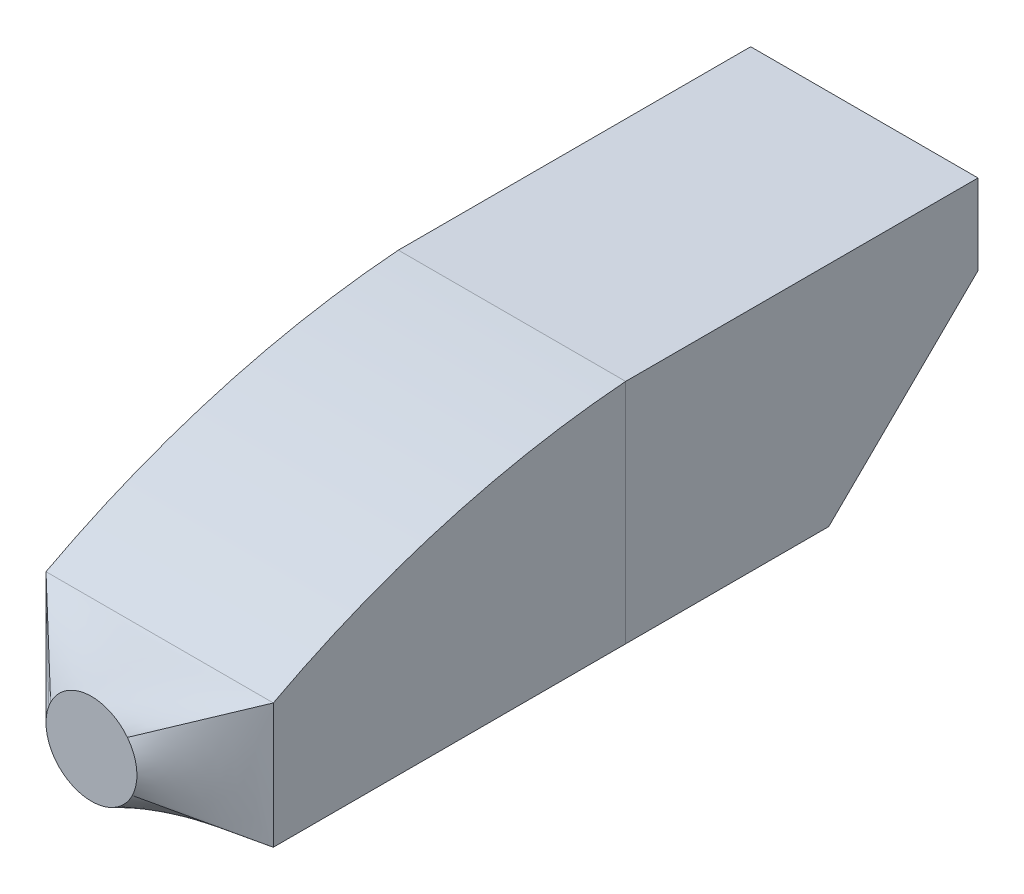
ISO-10303-21;
HEADER;
FILE_DESCRIPTION(('STEP AP214'),'2;1');
FILE_NAME('part.step','',(''),(''),'','','');
FILE_SCHEMA(('AUTOMOTIVE_DESIGN { 1 0 10303 214 1 1 1 1 }'));
ENDSEC;
DATA;
#1=APPLICATION_CONTEXT('core data for automotive mechanical design processes');
#2=APPLICATION_PROTOCOL_DEFINITION('international standard','automotive_design',2000,#1);
#3=PRODUCT_CONTEXT('',#1,'mechanical');
#4=PRODUCT('Part','Part','',(#3));
#5=PRODUCT_RELATED_PRODUCT_CATEGORY('part','',(#4));
#6=PRODUCT_DEFINITION_FORMATION('','',#4);
#7=PRODUCT_DEFINITION_CONTEXT('part definition',#1,'design');
#8=PRODUCT_DEFINITION('design','',#6,#7);
#9=PRODUCT_DEFINITION_SHAPE('','',#8);
#10=(LENGTH_UNIT() NAMED_UNIT(*) SI_UNIT(.MILLI.,.METRE.));
#11=(NAMED_UNIT(*) PLANE_ANGLE_UNIT() SI_UNIT($,.RADIAN.));
#12=(NAMED_UNIT(*) SI_UNIT($,.STERADIAN.) SOLID_ANGLE_UNIT());
#13=UNCERTAINTY_MEASURE_WITH_UNIT(LENGTH_MEASURE(1.E-05),#10,'distance_accuracy_value','');
#14=(GEOMETRIC_REPRESENTATION_CONTEXT(3) GLOBAL_UNCERTAINTY_ASSIGNED_CONTEXT((#13)) GLOBAL_UNIT_ASSIGNED_CONTEXT((#10,
#11,#12)) REPRESENTATION_CONTEXT('',''));
#15=CARTESIAN_POINT('',(0.,0.,0.));
#16=DIRECTION('',(0.,0.,1.));
#17=DIRECTION('',(1.,0.,0.));
#18=AXIS2_PLACEMENT_3D('',#15,#16,#17);
#19=CARTESIAN_POINT('',(-0.011546711005811,50.,0.));
#20=DIRECTION('',(0.,0.,1.));
#21=DIRECTION('',(1.,0.,0.));
#22=AXIS2_PLACEMENT_3D('',#19,#20,#21);
#23=PLANE('',#22);
#24=DIRECTION('',(1.,0.,0.));
#25=VECTOR('',#24,1.);
#26=CARTESIAN_POINT('',(100.,-50.,0.));
#27=LINE('',#26,#25);
#28=CARTESIAN_POINT('',(0.,-50.,0.));
#29=VERTEX_POINT('',#28);
#30=CARTESIAN_POINT('',(100.,-50.,0.));
#31=VERTEX_POINT('',#30);
#32=EDGE_CURVE('E160',#29,#31,#27,.T.);
#33=ORIENTED_EDGE('',*,*,#32,.F.);
#34=DIRECTION('',(0.,1.,0.));
#35=VECTOR('',#34,1.);
#36=CARTESIAN_POINT('',(0.,-345.373171481383,0.));
#37=LINE('',#36,#35);
#38=CARTESIAN_POINT('',(0.,50.,0.));
#39=VERTEX_POINT('',#38);
#40=EDGE_CURVE('E13',#29,#39,#37,.T.);
#41=ORIENTED_EDGE('',*,*,#40,.T.);
#42=DIRECTION('',(-1.,0.,0.));
#43=VECTOR('',#42,1.);
#44=CARTESIAN_POINT('',(100.,50.,0.));
#45=LINE('',#44,#43);
#46=CARTESIAN_POINT('',(100.,50.,0.));
#47=VERTEX_POINT('',#46);
#48=EDGE_CURVE('E619',#47,#39,#45,.T.);
#49=ORIENTED_EDGE('',*,*,#48,.F.);
#50=DIRECTION('',(0.,1.,0.));
#51=VECTOR('',#50,1.);
#52=CARTESIAN_POINT('',(100.,-345.373171481383,0.));
#53=LINE('',#52,#51);
#54=EDGE_CURVE('E154',#31,#47,#53,.T.);
#55=ORIENTED_EDGE('',*,*,#54,.F.);
#56=EDGE_LOOP('',(#33,#41,#49,#55));
#57=FACE_BOUND('',#56,.T.);
#58=ADVANCED_FACE('F151',(#57),#23,.F.);
#59=CARTESIAN_POINT('',(100.,-345.373171481383,-30.753501397821));
#60=DIRECTION('',(-1.,0.,0.));
#61=DIRECTION('',(0.,0.,1.));
#62=AXIS2_PLACEMENT_3D('',#59,#60,#61);
#63=CYLINDRICAL_SURFACE('',#62,396.567425005475);
#64=CARTESIAN_POINT('',(0.,-345.373171481383,-30.753501397821));
#65=DIRECTION('',(1.,0.,0.));
#66=DIRECTION('',(0.,0.,1.));
#67=AXIS2_PLACEMENT_3D('',#64,#65,#66);
#68=CIRCLE('',#67,396.567425005475);
#69=CARTESIAN_POINT('',(0.,5.,155.));
#70=VERTEX_POINT('',#69);
#71=EDGE_CURVE('E243',#39,#70,#68,.T.);
#72=ORIENTED_EDGE('',*,*,#71,.T.);
#73=CARTESIAN_POINT('',(99.9999999999998,4.99999999999992,155.));
#74=CARTESIAN_POINT('',(95.8333333333332,4.99999999999993,155.));
#75=CARTESIAN_POINT('',(87.4999999999999,4.99999999999994,155.));
#76=CARTESIAN_POINT('',(74.9999999999999,4.99999999999996,155.));
#77=CARTESIAN_POINT('',(62.5,4.99999999999996,155.));
#78=CARTESIAN_POINT('',(50.,4.99999999999996,155.));
#79=CARTESIAN_POINT('',(37.5,4.99999999999996,155.));
#80=CARTESIAN_POINT('',(25.0000000000001,4.99999999999995,155.));
#81=CARTESIAN_POINT('',(12.5000000000001,4.99999999999993,155.));
#82=CARTESIAN_POINT('',(4.16666666666682,4.99999999999991,155.));
#83=CARTESIAN_POINT('',(1.70715580257009E-13,4.9999999999999,155.));
#84=B_SPLINE_CURVE_WITH_KNOTS('',3,(#73,#74,#75,#76,#77,#78,#79,#80,#81,#82,#83),.UNSPECIFIED.,
.F.,.F.,(4,1,1,1,1,1,1,1,4),(0.,0.125,0.25,0.375,0.5,0.625,0.75,0.875,1.),.UNSPECIFIED.);
#85=CARTESIAN_POINT('',(100.,5.,155.));
#86=VERTEX_POINT('',#85);
#87=EDGE_CURVE('E411',#86,#70,#84,.T.);
#88=ORIENTED_EDGE('',*,*,#87,.F.);
#89=CARTESIAN_POINT('',(100.,-345.373171481383,-30.753501397821));
#90=DIRECTION('',(1.,0.,0.));
#91=DIRECTION('',(0.,0.,1.));
#92=AXIS2_PLACEMENT_3D('',#89,#90,#91);
#93=CIRCLE('',#92,396.567425005475);
#94=EDGE_CURVE('E415',#47,#86,#93,.T.);
#95=ORIENTED_EDGE('',*,*,#94,.F.);
#96=ORIENTED_EDGE('',*,*,#48,.T.);
#97=EDGE_LOOP('',(#72,#88,#95,#96));
#98=FACE_BOUND('',#97,.T.);
#99=ADVANCED_FACE('F417',(#98),#63,.T.);
#100=CARTESIAN_POINT('',(100.,-50.,-89.3390832636151));
#101=DIRECTION('',(0.,1.,0.));
#102=DIRECTION('',(0.,0.,1.));
#103=AXIS2_PLACEMENT_3D('',#100,#101,#102);
#104=PLANE('',#103);
#105=DIRECTION('',(0.,0.,-1.));
#106=VECTOR('',#105,1.);
#107=CARTESIAN_POINT('',(0.,-50.,-89.3390832636151));
#108=LINE('',#107,#106);
#109=CARTESIAN_POINT('',(0.,-50.,155.));
#110=VERTEX_POINT('',#109);
#111=EDGE_CURVE('E440',#110,#29,#108,.T.);
#112=ORIENTED_EDGE('',*,*,#111,.T.);
#113=ORIENTED_EDGE('',*,*,#32,.T.);
#114=DIRECTION('',(0.,0.,-1.));
#115=VECTOR('',#114,1.);
#116=CARTESIAN_POINT('',(100.,-50.,-89.3390832636151));
#117=LINE('',#116,#115);
#118=CARTESIAN_POINT('',(100.,-50.,155.));
#119=VERTEX_POINT('',#118);
#120=EDGE_CURVE('E515',#119,#31,#117,.T.);
#121=ORIENTED_EDGE('',*,*,#120,.F.);
#122=CARTESIAN_POINT('',(0.,-50.,155.));
#123=CARTESIAN_POINT('',(4.16666666666667,-50.,155.));
#124=CARTESIAN_POINT('',(12.5,-50.,155.));
#125=CARTESIAN_POINT('',(25.,-50.,155.));
#126=CARTESIAN_POINT('',(37.5,-50.,155.));
#127=CARTESIAN_POINT('',(50.,-50.,155.));
#128=CARTESIAN_POINT('',(62.5,-50.,155.));
#129=CARTESIAN_POINT('',(75.,-50.,155.));
#130=CARTESIAN_POINT('',(87.5,-50.,155.));
#131=CARTESIAN_POINT('',(95.8333333333333,-50.,155.));
#132=CARTESIAN_POINT('',(100.,-50.,155.));
#133=B_SPLINE_CURVE_WITH_KNOTS('',3,(#122,#123,#124,#125,#126,#127,#128,#129,#130,#131,#132),
.UNSPECIFIED.,.F.,.F.,(4,1,1,1,1,1,1,1,4),(0.,0.125,0.25,0.375,0.5,0.625,0.75,0.875,1.),.UNSPECIFIED.);
#134=EDGE_CURVE('E604',#119,#110,#133,.F.);
#135=ORIENTED_EDGE('',*,*,#134,.T.);
#136=EDGE_LOOP('',(#112,#113,#121,#135));
#137=FACE_BOUND('',#136,.T.);
#138=ADVANCED_FACE('F426',(#137),#104,.F.);
#139=CARTESIAN_POINT('',(100.,-345.373171481383,-30.753501397821));
#140=DIRECTION('',(-1.,0.,0.));
#141=DIRECTION('',(0.,0.,1.));
#142=AXIS2_PLACEMENT_3D('',#139,#140,#141);
#143=PLANE('',#142);
#144=ORIENTED_EDGE('',*,*,#120,.T.);
#145=ORIENTED_EDGE('',*,*,#54,.T.);
#146=ORIENTED_EDGE('',*,*,#94,.T.);
#147=CARTESIAN_POINT('',(100.,-50.,155.));
#148=CARTESIAN_POINT('',(100.,-45.4166666666667,155.));
#149=CARTESIAN_POINT('',(100.,-36.25,155.));
#150=CARTESIAN_POINT('',(99.9999999999999,-22.5,155.));
#151=CARTESIAN_POINT('',(100.,-8.75,155.));
#152=CARTESIAN_POINT('',(100.,0.416666666666671,155.));
#153=CARTESIAN_POINT('',(100.,5.,155.));
#154=B_SPLINE_CURVE_WITH_KNOTS('',3,(#147,#148,#149,#150,#151,#152,#153),.UNSPECIFIED.,.F.,.F.,
(4,1,1,1,4),(0.,0.25,0.5,0.75,1.),.UNSPECIFIED.);
#155=EDGE_CURVE('E510',#86,#119,#154,.F.);
#156=ORIENTED_EDGE('',*,*,#155,.T.);
#157=EDGE_LOOP('',(#144,#145,#146,#156));
#158=FACE_BOUND('',#157,.T.);
#159=ADVANCED_FACE('F430',(#158),#143,.F.);
#160=CARTESIAN_POINT('',(0.,-345.373171481383,-30.753501397821));
#161=DIRECTION('',(-1.,0.,0.));
#162=DIRECTION('',(0.,0.,1.));
#163=AXIS2_PLACEMENT_3D('',#160,#161,#162);
#164=PLANE('',#163);
#165=ORIENTED_EDGE('',*,*,#40,.F.);
#166=ORIENTED_EDGE('',*,*,#111,.F.);
#167=DIRECTION('',(0.,-1.,0.));
#168=VECTOR('',#167,1.);
#169=CARTESIAN_POINT('',(0.,-24.9999999999999,155.));
#170=LINE('',#169,#168);
#171=CARTESIAN_POINT('',(0.,1.59594559789866E-13,155.));
#172=VERTEX_POINT('',#171);
#173=EDGE_CURVE('E253',#172,#110,#170,.T.);
#174=ORIENTED_EDGE('',*,*,#173,.F.);
#175=CARTESIAN_POINT('',(0.,5.,155.));
#176=CARTESIAN_POINT('',(0.,4.58333333333335,155.));
#177=CARTESIAN_POINT('',(0.,3.75000000000005,155.));
#178=CARTESIAN_POINT('',(0.,2.50000000000008,155.));
#179=CARTESIAN_POINT('',(0.,1.25000000000012,155.));
#180=CARTESIAN_POINT('',(0.,0.416666666666813,155.));
#181=CARTESIAN_POINT('',(0.,1.59594559789866E-13,155.));
#182=B_SPLINE_CURVE_WITH_KNOTS('',3,(#175,#176,#177,#178,#179,#180,#181),.UNSPECIFIED.,.F.,.F.,
(4,1,1,1,4),(0.,0.25,0.5,0.75,1.),.UNSPECIFIED.);
#183=EDGE_CURVE('E250',#70,#172,#182,.T.);
#184=ORIENTED_EDGE('',*,*,#183,.F.);
#185=ORIENTED_EDGE('',*,*,#71,.F.);
#186=EDGE_LOOP('',(#165,#166,#174,#184,#185));
#187=FACE_BOUND('',#186,.T.);
#188=ADVANCED_FACE('F432',(#187),#164,.T.);
#189=CARTESIAN_POINT('',(31.2377571557696,-15.5733670911383,185.));
#190=CARTESIAN_POINT('',(0.,1.59594559789866E-13,155.));
#191=CARTESIAN_POINT('',(30.6527932025279,-17.1578650557701,185.));
#192=CARTESIAN_POINT('',(0.,-4.16666666666652,155.));
#193=CARTESIAN_POINT('',(29.8862845018886,-20.4757008253338,185.));
#194=CARTESIAN_POINT('',(0.,-12.4999999999999,155.));
#195=CARTESIAN_POINT('',(30.0211479213596,-25.5818764213983,185.));
#196=CARTESIAN_POINT('',(0.,-24.9999999999999,155.));
#197=CARTESIAN_POINT('',(31.4312655328549,-30.4913352186088,185.));
#198=CARTESIAN_POINT('',(0.,-37.5,155.));
#199=CARTESIAN_POINT('',(33.1619513204145,-33.4239614284574,185.));
#200=CARTESIAN_POINT('',(0.,-45.8333333333333,155.));
#201=CARTESIAN_POINT('',(34.197201540508,-34.758530125944,185.));
#202=CARTESIAN_POINT('',(0.,-50.,155.));
#203=B_SPLINE_SURFACE_WITH_KNOTS('',3,1,((#189,#190),(#191,#192),(#193,#194),(#195,#196),(#197,
#198),(#199,#200),(#201,#202)),.UNSPECIFIED.,.F.,.F.,.F.,(4,1,1,1,4),(2,2),(0.,0.25,0.5,0.75,
1.),(0.,1.),.UNSPECIFIED.);
#204=CARTESIAN_POINT('',(50.,-22.5,185.));
#205=DIRECTION('',(0.,0.,1.));
#206=DIRECTION('',(1.,0.,0.));
#207=AXIS2_PLACEMENT_3D('',#204,#205,#206);
#208=CIRCLE('',#207,20.);
#209=CARTESIAN_POINT('',(31.2377571557696,-15.5733670911383,185.));
#210=VERTEX_POINT('',#209);
#211=CARTESIAN_POINT('',(34.197201540508,-34.758530125944,185.));
#212=VERTEX_POINT('',#211);
#213=EDGE_CURVE('E216',#210,#212,#208,.T.);
#214=DIRECTION('',(-0.678708548752196,0.338365437854734,-0.651815569249509));
#215=VECTOR('',#214,1.);
#216=CARTESIAN_POINT('',(15.6188785778848,-7.78668354556909,170.));
#217=LINE('',#216,#215);
#218=EDGE_CURVE('E229',#210,#172,#217,.T.);
#219=DIRECTION('',(-0.712789671289217,-0.31768571146455,-0.625305264038831));
#220=VECTOR('',#219,1.);
#221=CARTESIAN_POINT('',(17.098600770254,-42.379265062972,170.));
#222=LINE('',#221,#220);
#223=EDGE_CURVE('E240',#212,#110,#222,.T.);
#224=ORIENTED_EDGE('',*,*,#213,.F.);
#225=ORIENTED_EDGE('',*,*,#218,.T.);
#226=ORIENTED_EDGE('',*,*,#173,.T.);
#227=ORIENTED_EDGE('',*,*,#223,.F.);
#228=EDGE_LOOP('',(#224,#225,#226,#227));
#229=FACE_BOUND('',#228,.T.);
#230=ADVANCED_FACE('F236',(#229),#203,.F.);
#231=CARTESIAN_POINT('',(34.197201540508,-34.758530125944,185.));
#232=CARTESIAN_POINT('',(0.,-50.,155.));
#233=CARTESIAN_POINT('',(35.2324517606014,-36.0930988234306,185.));
#234=CARTESIAN_POINT('',(4.16666666666667,-50.,155.));
#235=CARTESIAN_POINT('',(37.6426440813359,-38.4985823990113,185.));
#236=CARTESIAN_POINT('',(12.5,-50.,155.));
#237=CARTESIAN_POINT('',(42.047325797671,-41.0851725577531,185.));
#238=CARTESIAN_POINT('',(25.,-50.,155.));
#239=CARTESIAN_POINT('',(46.9595881168127,-42.48530830943,185.));
#240=CARTESIAN_POINT('',(37.5,-50.,155.));
#241=CARTESIAN_POINT('',(52.06601026029,-42.6093199757758,185.));
#242=CARTESIAN_POINT('',(50.,-50.,155.));
#243=CARTESIAN_POINT('',(57.0405433408698,-41.4496016345392,185.));
#244=CARTESIAN_POINT('',(62.5,-50.,155.));
#245=CARTESIAN_POINT('',(61.5654961833166,-39.0798963809651,185.));
#246=CARTESIAN_POINT('',(75.,-50.,155.));
#247=CARTESIAN_POINT('',(65.3522280786529,-35.6517290536081,185.));
#248=CARTESIAN_POINT('',(87.5,-50.,155.));
#249=CARTESIAN_POINT('',(67.2229603226969,-32.8064278171111,185.));
#250=CARTESIAN_POINT('',(95.8333333333333,-50.,155.));
#251=CARTESIAN_POINT('',(67.9652240153415,-31.2892392206947,185.));
#252=CARTESIAN_POINT('',(100.,-50.,155.));
#253=B_SPLINE_SURFACE_WITH_KNOTS('',3,1,((#231,#232),(#233,#234),(#235,#236),(#237,#238),(#239,
#240),(#241,#242),(#243,#244),(#245,#246),(#247,#248),(#249,#250),(#251,#252)),.UNSPECIFIED.,
.F.,.F.,.F.,(4,1,1,1,1,1,1,1,4),(2,2),(0.,0.125,0.25,0.375,0.5,0.625,0.75,0.875,1.),(0.,1.),.UNSPECIFIED.);
#254=CARTESIAN_POINT('',(50.,-22.5,185.));
#255=DIRECTION('',(0.,0.,1.));
#256=DIRECTION('',(1.,0.,0.));
#257=AXIS2_PLACEMENT_3D('',#254,#255,#256);
#258=CIRCLE('',#257,20.);
#259=CARTESIAN_POINT('',(67.9652240153415,-31.2892392206947,185.));
#260=VERTEX_POINT('',#259);
#261=EDGE_CURVE('E454',#212,#260,#258,.T.);
#262=DIRECTION('',(0.671436718483072,-0.392170428286903,-0.628788587881453));
#263=VECTOR('',#262,1.);
#264=CARTESIAN_POINT('',(83.9826120076707,-40.6446196103473,170.));
#265=LINE('',#264,#263);
#266=EDGE_CURVE('E470',#260,#119,#265,.T.);
#267=ORIENTED_EDGE('',*,*,#261,.F.);
#268=ORIENTED_EDGE('',*,*,#223,.T.);
#269=ORIENTED_EDGE('',*,*,#134,.F.);
#270=ORIENTED_EDGE('',*,*,#266,.F.);
#271=EDGE_LOOP('',(#267,#268,#269,#270));
#272=FACE_BOUND('',#271,.T.);
#273=ADVANCED_FACE('F327',(#272),#253,.F.);
#274=CARTESIAN_POINT('',(67.9652240153415,-31.2892392206947,185.));
#275=CARTESIAN_POINT('',(100.,-50.,155.));
#276=CARTESIAN_POINT('',(68.7817140772505,-29.6203317646366,185.));
#277=CARTESIAN_POINT('',(100.,-45.4166666666667,155.));
#278=CARTESIAN_POINT('',(69.9467251690195,-26.0537089858299,185.));
#279=CARTESIAN_POINT('',(100.,-36.25,155.));
#280=CARTESIAN_POINT('',(70.1546110532987,-20.4293365823197,185.000000000001));
#281=CARTESIAN_POINT('',(99.9999999999999,-22.5,155.));
#282=CARTESIAN_POINT('',(68.8074549473128,-14.9647275477815,184.999999999999));
#283=CARTESIAN_POINT('',(100.,-8.75,155.));
#284=CARTESIAN_POINT('',(66.9415737015948,-11.7094954412913,185.));
#285=CARTESIAN_POINT('',(100.,0.416666666666671,155.));
#286=CARTESIAN_POINT('',(65.8027984594921,-10.241469874056,185.));
#287=CARTESIAN_POINT('',(100.,5.,155.));
#288=B_SPLINE_SURFACE_WITH_KNOTS('',3,1,((#274,#275),(#276,#277),(#278,#279),(#280,#281),(#282,
#283),(#284,#285),(#286,#287)),.UNSPECIFIED.,.F.,.F.,.F.,(4,1,1,1,4),(2,2),(0.,0.25,0.5,0.75,
1.),(0.,1.),.UNSPECIFIED.);
#289=CARTESIAN_POINT('',(50.,-22.5,185.));
#290=DIRECTION('',(0.,0.,-1.));
#291=DIRECTION('',(1.,0.,0.));
#292=AXIS2_PLACEMENT_3D('',#289,#290,#291);
#293=CIRCLE('',#292,20.);
#294=CARTESIAN_POINT('',(65.8027984594921,-10.241469874056,185.));
#295=VERTEX_POINT('',#294);
#296=EDGE_CURVE('E474',#260,#295,#293,.F.);
#297=DIRECTION('',(0.712789671289216,0.317685711464551,-0.625305264038832));
#298=VECTOR('',#297,1.);
#299=CARTESIAN_POINT('',(82.901399229746,-2.62073493702802,170.));
#300=LINE('',#299,#298);
#301=EDGE_CURVE('E373',#295,#86,#300,.T.);
#302=ORIENTED_EDGE('',*,*,#296,.F.);
#303=ORIENTED_EDGE('',*,*,#266,.T.);
#304=ORIENTED_EDGE('',*,*,#155,.F.);
#305=ORIENTED_EDGE('',*,*,#301,.F.);
#306=EDGE_LOOP('',(#302,#303,#304,#305));
#307=FACE_BOUND('',#306,.T.);
#308=ADVANCED_FACE('F337',(#307),#288,.F.);
#309=CARTESIAN_POINT('',(65.8027984594921,-10.241469874056,185.));
#310=CARTESIAN_POINT('',(100.,5.,155.));
#311=CARTESIAN_POINT('',(64.7675482393986,-8.90690117656947,185.));
#312=CARTESIAN_POINT('',(95.8333333333333,5.,155.));
#313=CARTESIAN_POINT('',(62.3573559186641,-6.50141760098861,185.));
#314=CARTESIAN_POINT('',(87.5,5.00000000000001,155.));
#315=CARTESIAN_POINT('',(57.9526742023291,-3.91482744224696,185.));
#316=CARTESIAN_POINT('',(75.,5.00000000000001,155.));
#317=CARTESIAN_POINT('',(53.0404118831872,-2.51469169056997,185.));
#318=CARTESIAN_POINT('',(62.5,5.,155.));
#319=CARTESIAN_POINT('',(47.9339897397101,-2.39068002422433,185.));
#320=CARTESIAN_POINT('',(50.,5.,155.));
#321=CARTESIAN_POINT('',(42.9594566591302,-3.55039836546074,185.));
#322=CARTESIAN_POINT('',(37.5,5.,155.));
#323=CARTESIAN_POINT('',(38.4345038166833,-5.920103619035,185.));
#324=CARTESIAN_POINT('',(25.,5.00000000000001,155.));
#325=CARTESIAN_POINT('',(34.6477719213472,-9.3482709463919,185.));
#326=CARTESIAN_POINT('',(12.5,5.00000000000001,155.));
#327=CARTESIAN_POINT('',(32.7770396773031,-12.1935721828889,185.));
#328=CARTESIAN_POINT('',(4.16666666666667,5.,155.));
#329=CARTESIAN_POINT('',(32.0347759846585,-13.7107607793053,185.));
#330=CARTESIAN_POINT('',(0.,5.,155.));
#331=B_SPLINE_SURFACE_WITH_KNOTS('',3,1,((#309,#310),(#311,#312),(#313,#314),(#315,#316),(#317,
#318),(#319,#320),(#321,#322),(#323,#324),(#325,#326),(#327,#328),(#329,#330)),.UNSPECIFIED.,
.F.,.F.,.F.,(4,1,1,1,1,1,1,1,4),(2,2),(0.,0.125,0.25,0.375,0.5,0.625,0.75,0.875,1.),(0.,1.),.UNSPECIFIED.);
#332=CARTESIAN_POINT('',(50.,-22.5,185.));
#333=DIRECTION('',(0.,0.,1.));
#334=DIRECTION('',(1.,0.,0.));
#335=AXIS2_PLACEMENT_3D('',#332,#333,#334);
#336=CIRCLE('',#335,20.);
#337=CARTESIAN_POINT('',(32.0347759846585,-13.7107607793053,185.));
#338=VERTEX_POINT('',#337);
#339=EDGE_CURVE('E220',#295,#338,#336,.T.);
#340=DIRECTION('',(-0.671436718483071,0.392170428286903,-0.628788587881454));
#341=VECTOR('',#340,1.);
#342=CARTESIAN_POINT('',(16.0173879923293,-4.35538038965266,170.));
#343=LINE('',#342,#341);
#344=EDGE_CURVE('E228',#338,#70,#343,.T.);
#345=ORIENTED_EDGE('',*,*,#339,.F.);
#346=ORIENTED_EDGE('',*,*,#301,.T.);
#347=ORIENTED_EDGE('',*,*,#87,.T.);
#348=ORIENTED_EDGE('',*,*,#344,.F.);
#349=EDGE_LOOP('',(#345,#346,#347,#348));
#350=FACE_BOUND('',#349,.T.);
#351=ADVANCED_FACE('F276',(#350),#331,.F.);
#352=CARTESIAN_POINT('',(32.0347759846585,-13.7107607793053,185.));
#353=CARTESIAN_POINT('',(0.,5.,155.));
#354=CARTESIAN_POINT('',(31.9605496153941,-13.862479638947,185.));
#355=CARTESIAN_POINT('',(0.,4.58333333333335,155.));
#356=CARTESIAN_POINT('',(31.8159409754238,-14.1677978927364,185.));
#357=CARTESIAN_POINT('',(0.,3.75000000000005,155.));
#358=CARTESIAN_POINT('',(31.6106993622832,-14.6311235953371,185.));
#359=CARTESIAN_POINT('',(0.,2.50000000000008,155.));
#360=CARTESIAN_POINT('',(31.4172608821686,-15.0994999193179,185.));
#361=CARTESIAN_POINT('',(0.,1.25000000000012,155.));
#362=CARTESIAN_POINT('',(31.2962535510938,-15.4149172946752,185.));
#363=CARTESIAN_POINT('',(0.,0.416666666666813,155.));
#364=CARTESIAN_POINT('',(31.2377571557696,-15.5733670911383,185.));
#365=CARTESIAN_POINT('',(0.,1.59594559789866E-13,155.));
#366=B_SPLINE_SURFACE_WITH_KNOTS('',3,1,((#352,#353),(#354,#355),(#356,#357),(#358,#359),(#360,
#361),(#362,#363),(#364,#365)),.UNSPECIFIED.,.F.,.F.,.F.,(4,1,1,1,4),(2,2),(0.,0.25,0.5,0.75,
1.),(0.,1.),.UNSPECIFIED.);
#367=CARTESIAN_POINT('',(50.,-22.5,185.));
#368=DIRECTION('',(0.,0.,1.));
#369=DIRECTION('',(1.,0.,0.));
#370=AXIS2_PLACEMENT_3D('',#367,#368,#369);
#371=CIRCLE('',#370,20.);
#372=EDGE_CURVE('E211',#338,#210,#371,.T.);
#373=ORIENTED_EDGE('',*,*,#372,.F.);
#374=ORIENTED_EDGE('',*,*,#344,.T.);
#375=ORIENTED_EDGE('',*,*,#183,.T.);
#376=ORIENTED_EDGE('',*,*,#218,.F.);
#377=EDGE_LOOP('',(#373,#374,#375,#376));
#378=FACE_BOUND('',#377,.T.);
#379=ADVANCED_FACE('F249',(#378),#366,.F.);
#380=CARTESIAN_POINT('',(50.,-22.5,185.));
#381=DIRECTION('',(0.,0.,1.));
#382=DIRECTION('',(1.,0.,0.));
#383=AXIS2_PLACEMENT_3D('',#380,#381,#382);
#384=PLANE('',#383);
#385=ORIENTED_EDGE('',*,*,#372,.T.);
#386=ORIENTED_EDGE('',*,*,#213,.T.);
#387=ORIENTED_EDGE('',*,*,#261,.T.);
#388=ORIENTED_EDGE('',*,*,#296,.T.);
#389=ORIENTED_EDGE('',*,*,#339,.T.);
#390=EDGE_LOOP('',(#385,#386,#387,#388,#389));
#391=FACE_BOUND('',#390,.T.);
#392=ADVANCED_FACE('F214',(#391),#384,.T.);
#393=CLOSED_SHELL('',(#58,#99,#138,#159,#188,#230,#273,#308,#351,#379,#392));
#394=MANIFOLD_SOLID_BREP('B2',#393);
#395=CARTESIAN_POINT('',(-0.011546711005811,50.,0.));
#396=DIRECTION('',(0.,0.,1.));
#397=DIRECTION('',(1.,0.,0.));
#398=AXIS2_PLACEMENT_3D('',#395,#396,#397);
#399=PLANE('',#398);
#400=DIRECTION('',(1.,0.,0.));
#401=VECTOR('',#400,1.);
#402=CARTESIAN_POINT('',(100.,-50.,0.));
#403=LINE('',#402,#401);
#404=CARTESIAN_POINT('',(0.,-50.,0.));
#405=VERTEX_POINT('',#404);
#406=CARTESIAN_POINT('',(100.,-50.,0.));
#407=VERTEX_POINT('',#406);
#408=EDGE_CURVE('E831',#405,#407,#403,.T.);
#409=ORIENTED_EDGE('',*,*,#408,.T.);
#410=DIRECTION('',(0.,1.,0.));
#411=VECTOR('',#410,1.);
#412=CARTESIAN_POINT('',(100.,-345.373171481383,0.));
#413=LINE('',#412,#411);
#414=CARTESIAN_POINT('',(100.,50.,0.));
#415=VERTEX_POINT('',#414);
#416=EDGE_CURVE('E834',#407,#415,#413,.T.);
#417=ORIENTED_EDGE('',*,*,#416,.T.);
#418=DIRECTION('',(-1.,0.,0.));
#419=VECTOR('',#418,1.);
#420=CARTESIAN_POINT('',(100.,50.,0.));
#421=LINE('',#420,#419);
#422=CARTESIAN_POINT('',(0.,50.,0.));
#423=VERTEX_POINT('',#422);
#424=EDGE_CURVE('E821',#415,#423,#421,.T.);
#425=ORIENTED_EDGE('',*,*,#424,.T.);
#426=DIRECTION('',(0.,1.,0.));
#427=VECTOR('',#426,1.);
#428=CARTESIAN_POINT('',(0.,-345.373171481383,0.));
#429=LINE('',#428,#427);
#430=EDGE_CURVE('E827',#405,#423,#429,.T.);
#431=ORIENTED_EDGE('',*,*,#430,.F.);
#432=EDGE_LOOP('',(#409,#417,#425,#431));
#433=FACE_BOUND('',#432,.T.);
#434=ADVANCED_FACE('F763',(#433),#399,.T.);
#435=CARTESIAN_POINT('',(100.,14.6981334145522,-155.));
#436=DIRECTION('',(0.,0.712309781039747,0.701865212013751));
#437=DIRECTION('',(0.,-0.701865212013751,0.712309781039747));
#438=AXIS2_PLACEMENT_3D('',#435,#436,#437);
#439=PLANE('',#438);
#440=DIRECTION('',(0.,0.701865212013751,-0.712309781039747));
#441=VECTOR('',#440,1.);
#442=CARTESIAN_POINT('',(0.,14.6981334145522,-155.));
#443=LINE('',#442,#441);
#444=CARTESIAN_POINT('',(0.,-50.,-89.3390832636151));
#445=VERTEX_POINT('',#444);
#446=CARTESIAN_POINT('',(0.,14.6981334145522,-155.));
#447=VERTEX_POINT('',#446);
#448=EDGE_CURVE('E809',#445,#447,#443,.T.);
#449=ORIENTED_EDGE('',*,*,#448,.T.);
#450=DIRECTION('',(-1.,0.,0.));
#451=VECTOR('',#450,1.);
#452=CARTESIAN_POINT('',(100.,14.6981334145522,-155.));
#453=LINE('',#452,#451);
#454=CARTESIAN_POINT('',(100.,14.6981334145522,-155.));
#455=VERTEX_POINT('',#454);
#456=EDGE_CURVE('E846',#455,#447,#453,.T.);
#457=ORIENTED_EDGE('',*,*,#456,.F.);
#458=DIRECTION('',(0.,0.701865212013751,-0.712309781039747));
#459=VECTOR('',#458,1.);
#460=CARTESIAN_POINT('',(100.,14.6981334145522,-155.));
#461=LINE('',#460,#459);
#462=CARTESIAN_POINT('',(100.,-50.,-89.3390832636151));
#463=VERTEX_POINT('',#462);
#464=EDGE_CURVE('E841',#463,#455,#461,.T.);
#465=ORIENTED_EDGE('',*,*,#464,.F.);
#466=DIRECTION('',(-1.,0.,0.));
#467=VECTOR('',#466,1.);
#468=CARTESIAN_POINT('',(100.,-50.,-89.3390832636151));
#469=LINE('',#468,#467);
#470=EDGE_CURVE('E844',#463,#445,#469,.T.);
#471=ORIENTED_EDGE('',*,*,#470,.T.);
#472=EDGE_LOOP('',(#449,#457,#465,#471));
#473=FACE_BOUND('',#472,.T.);
#474=ADVANCED_FACE('F858',(#473),#439,.F.);
#475=CARTESIAN_POINT('',(100.,50.,-155.));
#476=DIRECTION('',(0.,0.,1.));
#477=DIRECTION('',(1.,0.,0.));
#478=AXIS2_PLACEMENT_3D('',#475,#476,#477);
#479=PLANE('',#478);
#480=DIRECTION('',(0.,1.,0.));
#481=VECTOR('',#480,1.);
#482=CARTESIAN_POINT('',(0.,50.,-155.));
#483=LINE('',#482,#481);
#484=CARTESIAN_POINT('',(0.,50.,-155.));
#485=VERTEX_POINT('',#484);
#486=EDGE_CURVE('E149',#447,#485,#483,.T.);
#487=ORIENTED_EDGE('',*,*,#486,.T.);
#488=DIRECTION('',(-1.,0.,0.));
#489=VECTOR('',#488,1.);
#490=CARTESIAN_POINT('',(100.,50.,-155.));
#491=LINE('',#490,#489);
#492=CARTESIAN_POINT('',(100.,50.,-155.));
#493=VERTEX_POINT('',#492);
#494=EDGE_CURVE('E823',#493,#485,#491,.T.);
#495=ORIENTED_EDGE('',*,*,#494,.F.);
#496=DIRECTION('',(0.,1.,0.));
#497=VECTOR('',#496,1.);
#498=CARTESIAN_POINT('',(100.,50.,-155.));
#499=LINE('',#498,#497);
#500=EDGE_CURVE('E848',#455,#493,#499,.T.);
#501=ORIENTED_EDGE('',*,*,#500,.F.);
#502=ORIENTED_EDGE('',*,*,#456,.T.);
#503=EDGE_LOOP('',(#487,#495,#501,#502));
#504=FACE_BOUND('',#503,.T.);
#505=ADVANCED_FACE('F857',(#504),#479,.F.);
#506=CARTESIAN_POINT('',(100.,50.,0.));
#507=DIRECTION('',(0.,-1.,0.));
#508=DIRECTION('',(0.,0.,-1.));
#509=AXIS2_PLACEMENT_3D('',#506,#507,#508);
#510=PLANE('',#509);
#511=DIRECTION('',(0.,0.,1.));
#512=VECTOR('',#511,1.);
#513=CARTESIAN_POINT('',(0.,50.,0.));
#514=LINE('',#513,#512);
#515=EDGE_CURVE('E773',#485,#423,#514,.T.);
#516=ORIENTED_EDGE('',*,*,#515,.T.);
#517=ORIENTED_EDGE('',*,*,#424,.F.);
#518=DIRECTION('',(0.,0.,1.));
#519=VECTOR('',#518,1.);
#520=CARTESIAN_POINT('',(100.,50.,0.));
#521=LINE('',#520,#519);
#522=EDGE_CURVE('E802',#493,#415,#521,.T.);
#523=ORIENTED_EDGE('',*,*,#522,.F.);
#524=ORIENTED_EDGE('',*,*,#494,.T.);
#525=EDGE_LOOP('',(#516,#517,#523,#524));
#526=FACE_BOUND('',#525,.T.);
#527=ADVANCED_FACE('F819',(#526),#510,.F.);
#528=CARTESIAN_POINT('',(100.,-50.,-89.3390832636151));
#529=DIRECTION('',(0.,1.,0.));
#530=DIRECTION('',(0.,0.,1.));
#531=AXIS2_PLACEMENT_3D('',#528,#529,#530);
#532=PLANE('',#531);
#533=ORIENTED_EDGE('',*,*,#408,.F.);
#534=DIRECTION('',(0.,0.,-1.));
#535=VECTOR('',#534,1.);
#536=CARTESIAN_POINT('',(0.,-50.,-89.3390832636151));
#537=LINE('',#536,#535);
#538=EDGE_CURVE('E824',#405,#445,#537,.T.);
#539=ORIENTED_EDGE('',*,*,#538,.T.);
#540=ORIENTED_EDGE('',*,*,#470,.F.);
#541=DIRECTION('',(0.,0.,-1.));
#542=VECTOR('',#541,1.);
#543=CARTESIAN_POINT('',(100.,-50.,-89.3390832636151));
#544=LINE('',#543,#542);
#545=EDGE_CURVE('E796',#407,#463,#544,.T.);
#546=ORIENTED_EDGE('',*,*,#545,.F.);
#547=EDGE_LOOP('',(#533,#539,#540,#546));
#548=FACE_BOUND('',#547,.T.);
#549=ADVANCED_FACE('F859',(#548),#532,.F.);
#550=CARTESIAN_POINT('',(0.,-345.373171481383,-30.753501397821));
#551=DIRECTION('',(-1.,0.,0.));
#552=DIRECTION('',(0.,0.,1.));
#553=AXIS2_PLACEMENT_3D('',#550,#551,#552);
#554=PLANE('',#553);
#555=ORIENTED_EDGE('',*,*,#538,.F.);
#556=ORIENTED_EDGE('',*,*,#430,.T.);
#557=ORIENTED_EDGE('',*,*,#515,.F.);
#558=ORIENTED_EDGE('',*,*,#486,.F.);
#559=ORIENTED_EDGE('',*,*,#448,.F.);
#560=EDGE_LOOP('',(#555,#556,#557,#558,#559));
#561=FACE_BOUND('',#560,.T.);
#562=ADVANCED_FACE('F765',(#561),#554,.T.);
#563=CARTESIAN_POINT('',(100.,-345.373171481383,-30.753501397821));
#564=DIRECTION('',(-1.,0.,0.));
#565=DIRECTION('',(0.,0.,1.));
#566=AXIS2_PLACEMENT_3D('',#563,#564,#565);
#567=PLANE('',#566);
#568=ORIENTED_EDGE('',*,*,#416,.F.);
#569=ORIENTED_EDGE('',*,*,#545,.T.);
#570=ORIENTED_EDGE('',*,*,#464,.T.);
#571=ORIENTED_EDGE('',*,*,#500,.T.);
#572=ORIENTED_EDGE('',*,*,#522,.T.);
#573=EDGE_LOOP('',(#568,#569,#570,#571,#572));
#574=FACE_BOUND('',#573,.T.);
#575=ADVANCED_FACE('F853',(#574),#567,.F.);
#576=CLOSED_SHELL('',(#434,#474,#505,#527,#549,#562,#575));
#577=MANIFOLD_SOLID_BREP('B7',#576);
#578=ADVANCED_BREP_SHAPE_REPRESENTATION('',(#18,#394,#577),#14);
#579=SHAPE_DEFINITION_REPRESENTATION(#9,#578);
ENDSEC;
END-ISO-10303-21;
